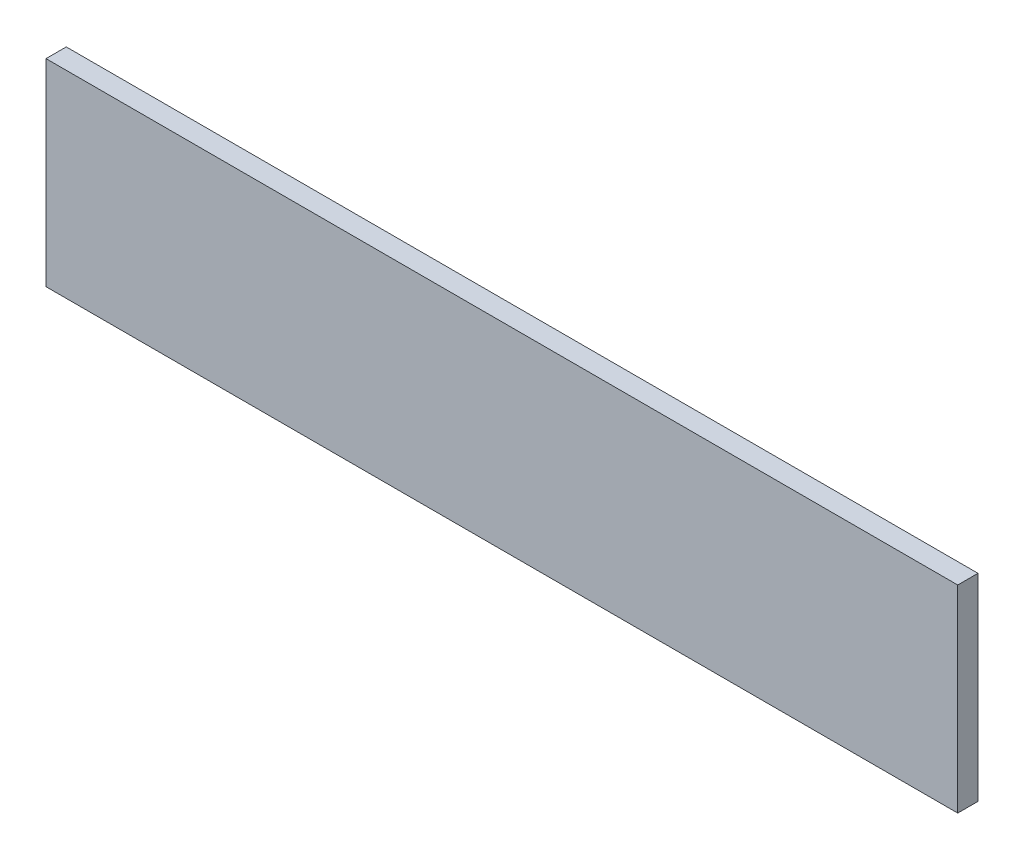
ISO-10303-21;
HEADER;
FILE_DESCRIPTION(('STEP AP214'),'2;1');
FILE_NAME('part.step','',(''),(''),'','','');
FILE_SCHEMA(('AUTOMOTIVE_DESIGN { 1 0 10303 214 1 1 1 1 }'));
ENDSEC;
DATA;
#1=APPLICATION_CONTEXT('core data for automotive mechanical design processes');
#2=APPLICATION_PROTOCOL_DEFINITION('international standard','automotive_design',2000,#1);
#3=PRODUCT_CONTEXT('',#1,'mechanical');
#4=PRODUCT('Part','Part','',(#3));
#5=PRODUCT_RELATED_PRODUCT_CATEGORY('part','',(#4));
#6=PRODUCT_DEFINITION_FORMATION('','',#4);
#7=PRODUCT_DEFINITION_CONTEXT('part definition',#1,'design');
#8=PRODUCT_DEFINITION('design','',#6,#7);
#9=PRODUCT_DEFINITION_SHAPE('','',#8);
#10=(LENGTH_UNIT() NAMED_UNIT(*) SI_UNIT(.MILLI.,.METRE.));
#11=(NAMED_UNIT(*) PLANE_ANGLE_UNIT() SI_UNIT($,.RADIAN.));
#12=(NAMED_UNIT(*) SI_UNIT($,.STERADIAN.) SOLID_ANGLE_UNIT());
#13=UNCERTAINTY_MEASURE_WITH_UNIT(LENGTH_MEASURE(1.E-05),#10,'distance_accuracy_value','');
#14=(GEOMETRIC_REPRESENTATION_CONTEXT(3) GLOBAL_UNCERTAINTY_ASSIGNED_CONTEXT((#13)) GLOBAL_UNIT_ASSIGNED_CONTEXT((#10,
#11,#12)) REPRESENTATION_CONTEXT('',''));
#15=CARTESIAN_POINT('',(0.,0.,0.));
#16=DIRECTION('',(0.,0.,1.));
#17=DIRECTION('',(1.,0.,0.));
#18=AXIS2_PLACEMENT_3D('',#15,#16,#17);
#19=CARTESIAN_POINT('',(-516.440831074977,330.266075388027,20.));
#20=DIRECTION('',(1.,0.,0.));
#21=DIRECTION('',(0.,0.,-1.));
#22=AXIS2_PLACEMENT_3D('',#19,#20,#21);
#23=PLANE('',#22);
#24=DIRECTION('',(0.,-1.,0.));
#25=VECTOR('',#24,1.);
#26=CARTESIAN_POINT('',(-516.440831074977,330.266075388027,0.));
#27=LINE('',#26,#25);
#28=CARTESIAN_POINT('',(-516.440831074977,330.266075388027,0.));
#29=VERTEX_POINT('',#28);
#30=CARTESIAN_POINT('',(-516.440831074977,135.266075388027,0.));
#31=VERTEX_POINT('',#30);
#32=EDGE_CURVE('E96',#29,#31,#27,.T.);
#33=ORIENTED_EDGE('',*,*,#32,.T.);
#34=DIRECTION('',(0.,0.,-1.));
#35=VECTOR('',#34,1.);
#36=CARTESIAN_POINT('',(-516.440831074977,135.266075388027,20.));
#37=LINE('',#36,#35);
#38=CARTESIAN_POINT('',(-516.440831074977,135.266075388027,20.));
#39=VERTEX_POINT('',#38);
#40=EDGE_CURVE('E11',#39,#31,#37,.T.);
#41=ORIENTED_EDGE('',*,*,#40,.F.);
#42=DIRECTION('',(0.,-1.,0.));
#43=VECTOR('',#42,1.);
#44=CARTESIAN_POINT('',(-516.440831074977,330.266075388027,20.));
#45=LINE('',#44,#43);
#46=CARTESIAN_POINT('',(-516.440831074977,330.266075388027,20.));
#47=VERTEX_POINT('',#46);
#48=EDGE_CURVE('E84',#47,#39,#45,.T.);
#49=ORIENTED_EDGE('',*,*,#48,.F.);
#50=DIRECTION('',(0.,0.,-1.));
#51=VECTOR('',#50,1.);
#52=CARTESIAN_POINT('',(-516.440831074977,330.266075388027,20.));
#53=LINE('',#52,#51);
#54=EDGE_CURVE('E92',#47,#29,#53,.T.);
#55=ORIENTED_EDGE('',*,*,#54,.T.);
#56=EDGE_LOOP('',(#33,#41,#49,#55));
#57=FACE_BOUND('',#56,.T.);
#58=ADVANCED_FACE('F33',(#57),#23,.F.);
#59=CARTESIAN_POINT('',(-516.440831074977,135.266075388027,20.));
#60=DIRECTION('',(0.,1.,0.));
#61=DIRECTION('',(0.,0.,1.));
#62=AXIS2_PLACEMENT_3D('',#59,#60,#61);
#63=PLANE('',#62);
#64=DIRECTION('',(1.,0.,0.));
#65=VECTOR('',#64,1.);
#66=CARTESIAN_POINT('',(-516.440831074977,135.266075388027,0.));
#67=LINE('',#66,#65);
#68=CARTESIAN_POINT('',(383.559168925023,135.266075388027,0.));
#69=VERTEX_POINT('',#68);
#70=EDGE_CURVE('E88',#31,#69,#67,.T.);
#71=ORIENTED_EDGE('',*,*,#70,.T.);
#72=DIRECTION('',(0.,0.,-1.));
#73=VECTOR('',#72,1.);
#74=CARTESIAN_POINT('',(383.559168925023,135.266075388027,20.));
#75=LINE('',#74,#73);
#76=CARTESIAN_POINT('',(383.559168925023,135.266075388027,20.));
#77=VERTEX_POINT('',#76);
#78=EDGE_CURVE('E41',#77,#69,#75,.T.);
#79=ORIENTED_EDGE('',*,*,#78,.F.);
#80=DIRECTION('',(1.,0.,0.));
#81=VECTOR('',#80,1.);
#82=CARTESIAN_POINT('',(-516.440831074977,135.266075388027,20.));
#83=LINE('',#82,#81);
#84=EDGE_CURVE('E79',#39,#77,#83,.T.);
#85=ORIENTED_EDGE('',*,*,#84,.F.);
#86=ORIENTED_EDGE('',*,*,#40,.T.);
#87=EDGE_LOOP('',(#71,#79,#85,#86));
#88=FACE_BOUND('',#87,.T.);
#89=ADVANCED_FACE('F87',(#88),#63,.F.);
#90=CARTESIAN_POINT('',(383.559168925022,330.266075388027,20.));
#91=DIRECTION('',(-1.,0.,0.));
#92=DIRECTION('',(0.,-1.,0.));
#93=AXIS2_PLACEMENT_3D('',#90,#91,#92);
#94=PLANE('',#93);
#95=DIRECTION('',(0.,1.,0.));
#96=VECTOR('',#95,1.);
#97=CARTESIAN_POINT('',(383.559168925022,330.266075388027,0.));
#98=LINE('',#97,#96);
#99=CARTESIAN_POINT('',(383.559168925022,330.266075388027,0.));
#100=VERTEX_POINT('',#99);
#101=EDGE_CURVE('E66',#69,#100,#98,.T.);
#102=ORIENTED_EDGE('',*,*,#101,.T.);
#103=DIRECTION('',(0.,0.,-1.));
#104=VECTOR('',#103,1.);
#105=CARTESIAN_POINT('',(383.559168925022,330.266075388027,20.));
#106=LINE('',#105,#104);
#107=CARTESIAN_POINT('',(383.559168925022,330.266075388027,20.));
#108=VERTEX_POINT('',#107);
#109=EDGE_CURVE('E89',#108,#100,#106,.T.);
#110=ORIENTED_EDGE('',*,*,#109,.F.);
#111=DIRECTION('',(0.,1.,0.));
#112=VECTOR('',#111,1.);
#113=CARTESIAN_POINT('',(383.559168925022,330.266075388027,20.));
#114=LINE('',#113,#112);
#115=EDGE_CURVE('E82',#77,#108,#114,.T.);
#116=ORIENTED_EDGE('',*,*,#115,.F.);
#117=ORIENTED_EDGE('',*,*,#78,.T.);
#118=EDGE_LOOP('',(#102,#110,#116,#117));
#119=FACE_BOUND('',#118,.T.);
#120=ADVANCED_FACE('F90',(#119),#94,.F.);
#121=CARTESIAN_POINT('',(-516.440831074977,330.266075388027,20.));
#122=DIRECTION('',(0.,-1.,0.));
#123=DIRECTION('',(0.,0.,-1.));
#124=AXIS2_PLACEMENT_3D('',#121,#122,#123);
#125=PLANE('',#124);
#126=DIRECTION('',(-1.,0.,0.));
#127=VECTOR('',#126,1.);
#128=CARTESIAN_POINT('',(-516.440831074977,330.266075388027,0.));
#129=LINE('',#128,#127);
#130=EDGE_CURVE('E72',#100,#29,#129,.T.);
#131=ORIENTED_EDGE('',*,*,#130,.T.);
#132=ORIENTED_EDGE('',*,*,#54,.F.);
#133=DIRECTION('',(-1.,0.,0.));
#134=VECTOR('',#133,1.);
#135=CARTESIAN_POINT('',(-516.440831074977,330.266075388027,20.));
#136=LINE('',#135,#134);
#137=EDGE_CURVE('E49',#108,#47,#136,.T.);
#138=ORIENTED_EDGE('',*,*,#137,.F.);
#139=ORIENTED_EDGE('',*,*,#109,.T.);
#140=EDGE_LOOP('',(#131,#132,#138,#139));
#141=FACE_BOUND('',#140,.T.);
#142=ADVANCED_FACE('F103',(#141),#125,.F.);
#143=CARTESIAN_POINT('',(0.,0.,20.));
#144=DIRECTION('',(0.,0.,1.));
#145=DIRECTION('',(1.,0.,0.));
#146=AXIS2_PLACEMENT_3D('',#143,#144,#145);
#147=PLANE('',#146);
#148=ORIENTED_EDGE('',*,*,#48,.T.);
#149=ORIENTED_EDGE('',*,*,#84,.T.);
#150=ORIENTED_EDGE('',*,*,#115,.T.);
#151=ORIENTED_EDGE('',*,*,#137,.T.);
#152=EDGE_LOOP('',(#148,#149,#150,#151));
#153=FACE_BOUND('',#152,.T.);
#154=ADVANCED_FACE('F80',(#153),#147,.T.);
#155=CARTESIAN_POINT('',(0.,0.,0.));
#156=DIRECTION('',(0.,0.,1.));
#157=DIRECTION('',(1.,0.,0.));
#158=AXIS2_PLACEMENT_3D('',#155,#156,#157);
#159=PLANE('',#158);
#160=ORIENTED_EDGE('',*,*,#32,.F.);
#161=ORIENTED_EDGE('',*,*,#130,.F.);
#162=ORIENTED_EDGE('',*,*,#101,.F.);
#163=ORIENTED_EDGE('',*,*,#70,.F.);
#164=EDGE_LOOP('',(#160,#161,#162,#163));
#165=FACE_BOUND('',#164,.T.);
#166=ADVANCED_FACE('F106',(#165),#159,.F.);
#167=CLOSED_SHELL('',(#58,#89,#120,#142,#154,#166));
#168=MANIFOLD_SOLID_BREP('B2',#167);
#169=ADVANCED_BREP_SHAPE_REPRESENTATION('',(#18,#168),#14);
#170=SHAPE_DEFINITION_REPRESENTATION(#9,#169);
ENDSEC;
END-ISO-10303-21;
